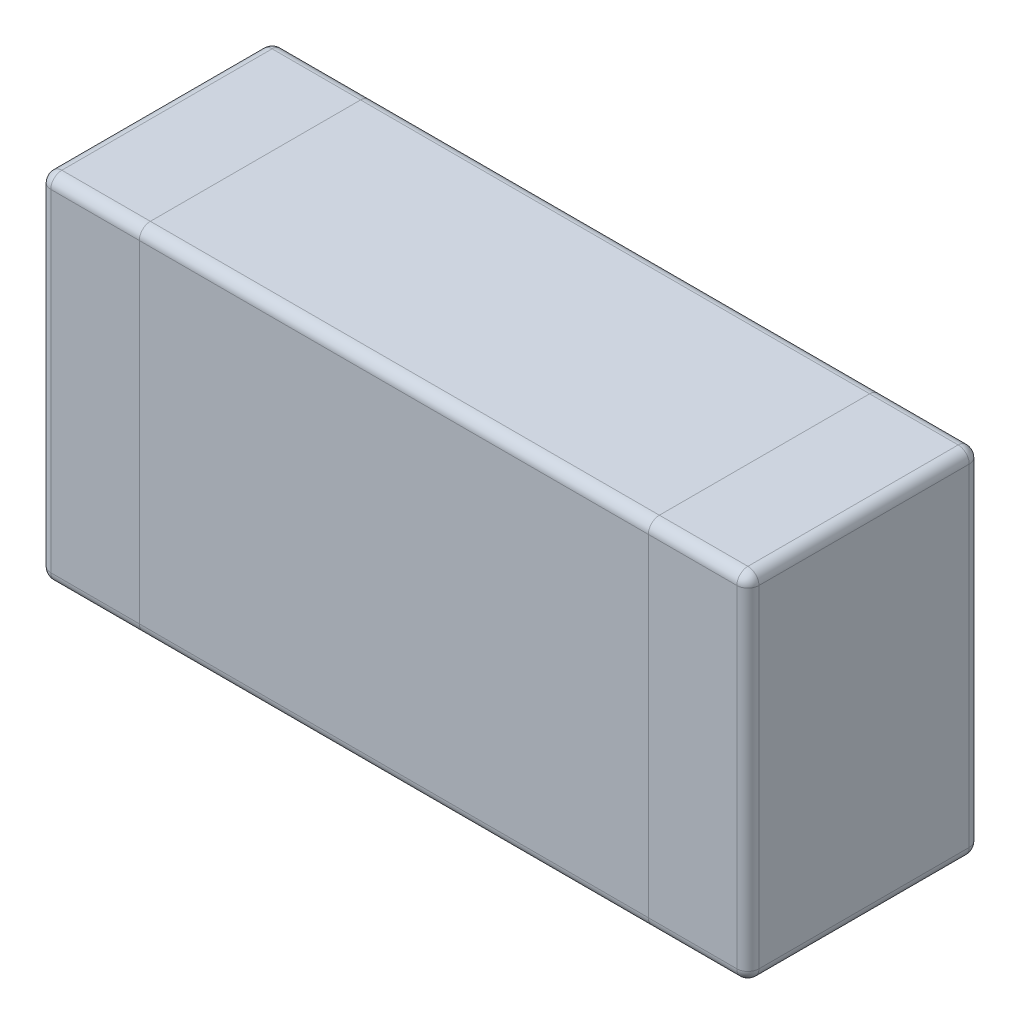
ISO-10303-21;
HEADER;
FILE_DESCRIPTION(('STEP AP214'),'2;1');
FILE_NAME('part.step','',(''),(''),'','','');
FILE_SCHEMA(('AUTOMOTIVE_DESIGN { 1 0 10303 214 1 1 1 1 }'));
ENDSEC;
DATA;
#1=APPLICATION_CONTEXT('core data for automotive mechanical design processes');
#2=APPLICATION_PROTOCOL_DEFINITION('international standard','automotive_design',2000,#1);
#3=PRODUCT_CONTEXT('',#1,'mechanical');
#4=PRODUCT('Part','Part','',(#3));
#5=PRODUCT_RELATED_PRODUCT_CATEGORY('part','',(#4));
#6=PRODUCT_DEFINITION_FORMATION('','',#4);
#7=PRODUCT_DEFINITION_CONTEXT('part definition',#1,'design');
#8=PRODUCT_DEFINITION('design','',#6,#7);
#9=PRODUCT_DEFINITION_SHAPE('','',#8);
#10=(LENGTH_UNIT() NAMED_UNIT(*) SI_UNIT(.MILLI.,.METRE.));
#11=(NAMED_UNIT(*) PLANE_ANGLE_UNIT() SI_UNIT($,.RADIAN.));
#12=(NAMED_UNIT(*) SI_UNIT($,.STERADIAN.) SOLID_ANGLE_UNIT());
#13=UNCERTAINTY_MEASURE_WITH_UNIT(LENGTH_MEASURE(1.E-05),#10,'distance_accuracy_value','');
#14=(GEOMETRIC_REPRESENTATION_CONTEXT(3) GLOBAL_UNCERTAINTY_ASSIGNED_CONTEXT((#13)) GLOBAL_UNIT_ASSIGNED_CONTEXT((#10,
#11,#12)) REPRESENTATION_CONTEXT('',''));
#15=CARTESIAN_POINT('',(0.,0.,0.));
#16=DIRECTION('',(0.,0.,1.));
#17=DIRECTION('',(1.,0.,0.));
#18=AXIS2_PLACEMENT_3D('',#15,#16,#17);
#19=CARTESIAN_POINT('',(1.55,0.749999999999718,1.0500000000002));
#20=DIRECTION('',(0.,2.68882138776405E-13,-1.));
#21=DIRECTION('',(0.,1.,2.68882138776405E-13));
#22=AXIS2_PLACEMENT_3D('',#19,#20,#21);
#23=CYLINDRICAL_SURFACE('',#22,0.05);
#24=CARTESIAN_POINT('',(1.55,0.749999999999731,1.0000000000002));
#25=DIRECTION('',(0.,2.68882138776405E-13,-1.));
#26=DIRECTION('',(0.,-1.,-2.68882138776405E-13));
#27=AXIS2_PLACEMENT_3D('',#24,#25,#26);
#28=CIRCLE('',#27,0.05);
#29=CARTESIAN_POINT('',(1.55,0.799999999999731,1.00000000000021));
#30=VERTEX_POINT('',#29);
#31=CARTESIAN_POINT('',(1.6,0.749999999999731,1.0000000000002));
#32=VERTEX_POINT('',#31);
#33=EDGE_CURVE('E27',#30,#32,#28,.T.);
#34=ORIENTED_EDGE('',*,*,#33,.T.);
#35=DIRECTION('',(0.,-2.68736422004423E-13,1.));
#36=VECTOR('',#35,1.);
#37=CARTESIAN_POINT('',(1.6,0.749999999999718,1.0500000000002));
#38=LINE('',#37,#36);
#39=CARTESIAN_POINT('',(1.6,0.749999999999987,0.0500000000002015));
#40=VERTEX_POINT('',#39);
#41=EDGE_CURVE('E208',#40,#32,#38,.T.);
#42=ORIENTED_EDGE('',*,*,#41,.F.);
#43=CARTESIAN_POINT('',(1.55,0.749999999999987,0.0500000000002015));
#44=DIRECTION('',(0.,-2.68746613504845E-13,1.));
#45=DIRECTION('',(0.,1.,2.68746613504845E-13));
#46=AXIS2_PLACEMENT_3D('',#43,#44,#45);
#47=CIRCLE('',#46,0.05);
#48=CARTESIAN_POINT('',(1.55,0.799999999999987,0.0500000000002149));
#49=VERTEX_POINT('',#48);
#50=EDGE_CURVE('E11',#40,#49,#47,.T.);
#51=ORIENTED_EDGE('',*,*,#50,.T.);
#52=DIRECTION('',(0.,2.68736422004423E-13,-1.));
#53=VECTOR('',#52,1.);
#54=CARTESIAN_POINT('',(1.55,0.799999999999718,1.05000000000021));
#55=LINE('',#54,#53);
#56=EDGE_CURVE('E210',#30,#49,#55,.T.);
#57=ORIENTED_EDGE('',*,*,#56,.F.);
#58=EDGE_LOOP('',(#34,#42,#51,#57));
#59=FACE_BOUND('',#58,.T.);
#60=ADVANCED_FACE('F17',(#59),#23,.T.);
#61=CARTESIAN_POINT('',(1.55,0.749999999999987,0.0500000000002016));
#62=DIRECTION('',(0.,-2.68736422004423E-13,1.));
#63=DIRECTION('',(1.,0.,0.));
#64=AXIS2_PLACEMENT_3D('',#61,#62,#63);
#65=SPHERICAL_SURFACE('',#64,0.05);
#66=CARTESIAN_POINT('',(1.55,0.749999999999987,0.0500000000002015));
#67=DIRECTION('',(0.,1.,2.68736422004423E-13));
#68=DIRECTION('',(-1.,0.,0.));
#69=AXIS2_PLACEMENT_3D('',#66,#67,#68);
#70=CIRCLE('',#69,0.05);
#71=CARTESIAN_POINT('',(1.55,0.75,2.01552316503317E-13));
#72=VERTEX_POINT('',#71);
#73=EDGE_CURVE('E196',#40,#72,#70,.T.);
#74=ORIENTED_EDGE('',*,*,#73,.T.);
#75=CARTESIAN_POINT('',(1.55,0.749999999999987,0.0500000000002016));
#76=DIRECTION('',(1.,0.,0.));
#77=DIRECTION('',(0.,1.,2.68746613504845E-13));
#78=AXIS2_PLACEMENT_3D('',#75,#76,#77);
#79=CIRCLE('',#78,0.05);
#80=EDGE_CURVE('E391',#72,#49,#79,.T.);
#81=ORIENTED_EDGE('',*,*,#80,.T.);
#82=ORIENTED_EDGE('',*,*,#50,.F.);
#83=EDGE_LOOP('',(#74,#81,#82));
#84=FACE_BOUND('',#83,.T.);
#85=ADVANCED_FACE('F761',(#84),#65,.T.);
#86=CARTESIAN_POINT('',(1.55,0.749999999999731,1.0000000000002));
#87=DIRECTION('',(0.,-2.68736422004423E-13,1.));
#88=DIRECTION('',(1.,0.,0.));
#89=AXIS2_PLACEMENT_3D('',#86,#87,#88);
#90=SPHERICAL_SURFACE('',#89,0.05);
#91=CARTESIAN_POINT('',(1.55,0.749999999999731,1.0000000000002));
#92=DIRECTION('',(1.,0.,0.));
#93=DIRECTION('',(0.,-2.68882138776406E-13,1.));
#94=AXIS2_PLACEMENT_3D('',#91,#92,#93);
#95=CIRCLE('',#94,0.05);
#96=CARTESIAN_POINT('',(1.55,0.749999999999718,1.0500000000002));
#97=VERTEX_POINT('',#96);
#98=EDGE_CURVE('E217',#30,#97,#95,.T.);
#99=ORIENTED_EDGE('',*,*,#98,.T.);
#100=CARTESIAN_POINT('',(1.55,0.749999999999731,1.0000000000002));
#101=DIRECTION('',(0.,1.,2.68736422004423E-13));
#102=DIRECTION('',(-1.,0.,0.));
#103=AXIS2_PLACEMENT_3D('',#100,#101,#102);
#104=CIRCLE('',#103,0.05);
#105=EDGE_CURVE('E199',#97,#32,#104,.T.);
#106=ORIENTED_EDGE('',*,*,#105,.T.);
#107=ORIENTED_EDGE('',*,*,#33,.F.);
#108=EDGE_LOOP('',(#99,#106,#107));
#109=FACE_BOUND('',#108,.T.);
#110=ADVANCED_FACE('F19',(#109),#90,.T.);
#111=CARTESIAN_POINT('',(1.55,-0.800000000000014,0.0499999999997849));
#112=DIRECTION('',(0.,-1.,-2.68736422004423E-13));
#113=DIRECTION('',(1.,0.,0.));
#114=AXIS2_PLACEMENT_3D('',#111,#112,#113);
#115=CYLINDRICAL_SURFACE('',#114,0.05);
#116=CARTESIAN_POINT('',(1.55,-0.750000000000014,0.0499999999997985));
#117=DIRECTION('',(0.,1.,2.68736422004423E-13));
#118=DIRECTION('',(1.,0.,0.));
#119=AXIS2_PLACEMENT_3D('',#116,#117,#118);
#120=CIRCLE('',#119,0.05);
#121=CARTESIAN_POINT('',(1.6,-0.750000000000014,0.0499999999997984));
#122=VERTEX_POINT('',#121);
#123=CARTESIAN_POINT('',(1.55,-0.75,-2.01552316503317E-13));
#124=VERTEX_POINT('',#123);
#125=EDGE_CURVE('E195',#122,#124,#120,.T.);
#126=ORIENTED_EDGE('',*,*,#125,.T.);
#127=DIRECTION('',(0.,-1.,-2.68736422004423E-13));
#128=VECTOR('',#127,1.);
#129=CARTESIAN_POINT('',(1.55,-0.8,-2.14989137603538E-13));
#130=LINE('',#129,#128);
#131=EDGE_CURVE('E355',#72,#124,#130,.T.);
#132=ORIENTED_EDGE('',*,*,#131,.F.);
#133=ORIENTED_EDGE('',*,*,#73,.F.);
#134=DIRECTION('',(0.,1.,2.68736422004423E-13));
#135=VECTOR('',#134,1.);
#136=CARTESIAN_POINT('',(1.6,0.799999999999987,0.0500000000002149));
#137=LINE('',#136,#135);
#138=EDGE_CURVE('E236',#122,#40,#137,.T.);
#139=ORIENTED_EDGE('',*,*,#138,.F.);
#140=EDGE_LOOP('',(#126,#132,#133,#139));
#141=FACE_BOUND('',#140,.T.);
#142=ADVANCED_FACE('F760',(#141),#115,.T.);
#143=CARTESIAN_POINT('',(-1.6,0.749999999999987,0.0500000000002015));
#144=DIRECTION('',(1.,0.,0.));
#145=DIRECTION('',(0.,1.,2.68746613504845E-13));
#146=AXIS2_PLACEMENT_3D('',#143,#144,#145);
#147=CYLINDRICAL_SURFACE('',#146,0.05);
#148=CARTESIAN_POINT('',(-1.15,0.749999999999987,0.0500000000002015));
#149=DIRECTION('',(-1.,0.,0.));
#150=DIRECTION('',(0.,1.,2.68746613504845E-13));
#151=AXIS2_PLACEMENT_3D('',#148,#149,#150);
#152=CIRCLE('',#151,0.05);
#153=CARTESIAN_POINT('',(-1.15,0.799999999999987,0.0500000000002149));
#154=VERTEX_POINT('',#153);
#155=CARTESIAN_POINT('',(-1.15,0.75,2.01552316503317E-13));
#156=VERTEX_POINT('',#155);
#157=EDGE_CURVE('E309',#154,#156,#152,.T.);
#158=ORIENTED_EDGE('',*,*,#157,.F.);
#159=DIRECTION('',(-1.,0.,0.));
#160=VECTOR('',#159,1.);
#161=CARTESIAN_POINT('',(-1.6,0.799999999999987,0.0500000000002149));
#162=LINE('',#161,#160);
#163=CARTESIAN_POINT('',(1.15,0.799999999999987,0.0500000000002149));
#164=VERTEX_POINT('',#163);
#165=EDGE_CURVE('E148',#164,#154,#162,.T.);
#166=ORIENTED_EDGE('',*,*,#165,.F.);
#167=CARTESIAN_POINT('',(1.15,0.749999999999987,0.0500000000002015));
#168=DIRECTION('',(1.,0.,0.));
#169=DIRECTION('',(0.,-1.,-2.68746613504845E-13));
#170=AXIS2_PLACEMENT_3D('',#167,#168,#169);
#171=CIRCLE('',#170,0.05);
#172=CARTESIAN_POINT('',(1.15,0.75,2.01552316503317E-13));
#173=VERTEX_POINT('',#172);
#174=EDGE_CURVE('E386',#173,#164,#171,.T.);
#175=ORIENTED_EDGE('',*,*,#174,.F.);
#176=DIRECTION('',(1.,0.,0.));
#177=VECTOR('',#176,1.);
#178=CARTESIAN_POINT('',(1.6,0.75,2.01552316503317E-13));
#179=LINE('',#178,#177);
#180=EDGE_CURVE('E176',#156,#173,#179,.T.);
#181=ORIENTED_EDGE('',*,*,#180,.F.);
#182=EDGE_LOOP('',(#158,#166,#175,#181));
#183=FACE_BOUND('',#182,.T.);
#184=ADVANCED_FACE('F771',(#183),#147,.T.);
#185=CARTESIAN_POINT('',(1.6,0.749999999999731,1.0000000000002));
#186=DIRECTION('',(-1.,0.,0.));
#187=DIRECTION('',(0.,-1.,-2.68882138776405E-13));
#188=AXIS2_PLACEMENT_3D('',#185,#186,#187);
#189=CYLINDRICAL_SURFACE('',#188,0.05);
#190=CARTESIAN_POINT('',(-1.15,0.749999999999731,1.0000000000002));
#191=DIRECTION('',(-1.,0.,0.));
#192=DIRECTION('',(0.,1.,2.68882138776405E-13));
#193=AXIS2_PLACEMENT_3D('',#190,#191,#192);
#194=CIRCLE('',#193,0.05);
#195=CARTESIAN_POINT('',(-1.15,0.749999999999718,1.0500000000002));
#196=VERTEX_POINT('',#195);
#197=CARTESIAN_POINT('',(-1.15,0.799999999999731,1.00000000000021));
#198=VERTEX_POINT('',#197);
#199=EDGE_CURVE('E358',#196,#198,#194,.T.);
#200=ORIENTED_EDGE('',*,*,#199,.F.);
#201=DIRECTION('',(-1.,0.,0.));
#202=VECTOR('',#201,1.);
#203=CARTESIAN_POINT('',(1.6,0.749999999999718,1.0500000000002));
#204=LINE('',#203,#202);
#205=CARTESIAN_POINT('',(1.15,0.749999999999718,1.0500000000002));
#206=VERTEX_POINT('',#205);
#207=EDGE_CURVE('E171',#206,#196,#204,.T.);
#208=ORIENTED_EDGE('',*,*,#207,.F.);
#209=CARTESIAN_POINT('',(1.15,0.749999999999731,1.0000000000002));
#210=DIRECTION('',(1.,0.,0.));
#211=DIRECTION('',(0.,-1.,-2.68882138776405E-13));
#212=AXIS2_PLACEMENT_3D('',#209,#210,#211);
#213=CIRCLE('',#212,0.05);
#214=CARTESIAN_POINT('',(1.15,0.799999999999731,1.00000000000021));
#215=VERTEX_POINT('',#214);
#216=EDGE_CURVE('E370',#215,#206,#213,.T.);
#217=ORIENTED_EDGE('',*,*,#216,.F.);
#218=DIRECTION('',(1.,0.,0.));
#219=VECTOR('',#218,1.);
#220=CARTESIAN_POINT('',(-1.6,0.799999999999731,1.00000000000021));
#221=LINE('',#220,#219);
#222=EDGE_CURVE('E142',#198,#215,#221,.T.);
#223=ORIENTED_EDGE('',*,*,#222,.F.);
#224=EDGE_LOOP('',(#200,#208,#217,#223));
#225=FACE_BOUND('',#224,.T.);
#226=ADVANCED_FACE('F555',(#225),#189,.T.);
#227=CARTESIAN_POINT('',(1.55,0.799999999999731,1.00000000000021));
#228=DIRECTION('',(0.,1.,2.68736422004423E-13));
#229=DIRECTION('',(-1.,0.,0.));
#230=AXIS2_PLACEMENT_3D('',#227,#228,#229);
#231=CYLINDRICAL_SURFACE('',#230,0.05);
#232=CARTESIAN_POINT('',(1.55,-0.750000000000269,0.999999999999799));
#233=DIRECTION('',(0.,1.,2.71050543121376E-13));
#234=DIRECTION('',(0.,2.71050543121376E-13,-1.));
#235=AXIS2_PLACEMENT_3D('',#232,#233,#234);
#236=CIRCLE('',#235,0.05);
#237=CARTESIAN_POINT('',(1.55,-0.750000000000283,1.0499999999998));
#238=VERTEX_POINT('',#237);
#239=CARTESIAN_POINT('',(1.6,-0.750000000000269,0.999999999999799));
#240=VERTEX_POINT('',#239);
#241=EDGE_CURVE('E159',#238,#240,#236,.T.);
#242=ORIENTED_EDGE('',*,*,#241,.T.);
#243=DIRECTION('',(0.,-1.,-2.68736422004423E-13));
#244=VECTOR('',#243,1.);
#245=CARTESIAN_POINT('',(1.6,-0.800000000000269,0.999999999999786));
#246=LINE('',#245,#244);
#247=EDGE_CURVE('E224',#32,#240,#246,.T.);
#248=ORIENTED_EDGE('',*,*,#247,.F.);
#249=ORIENTED_EDGE('',*,*,#105,.F.);
#250=DIRECTION('',(0.,1.,2.68736422004423E-13));
#251=VECTOR('',#250,1.);
#252=CARTESIAN_POINT('',(1.55,0.799999999999718,1.05000000000021));
#253=LINE('',#252,#251);
#254=EDGE_CURVE('E267',#238,#97,#253,.T.);
#255=ORIENTED_EDGE('',*,*,#254,.F.);
#256=EDGE_LOOP('',(#242,#248,#249,#255));
#257=FACE_BOUND('',#256,.T.);
#258=ADVANCED_FACE('F225',(#257),#231,.T.);
#259=CARTESIAN_POINT('',(1.55,-0.750000000000014,0.0499999999997985));
#260=DIRECTION('',(0.,-2.68736422004423E-13,1.));
#261=DIRECTION('',(1.,0.,0.));
#262=AXIS2_PLACEMENT_3D('',#259,#260,#261);
#263=SPHERICAL_SURFACE('',#262,0.05);
#264=CARTESIAN_POINT('',(1.55,-0.750000000000014,0.0499999999997984));
#265=DIRECTION('',(0.,2.68746613504845E-13,-1.));
#266=DIRECTION('',(0.,1.,2.68746613504845E-13));
#267=AXIS2_PLACEMENT_3D('',#264,#265,#266);
#268=CIRCLE('',#267,0.05);
#269=CARTESIAN_POINT('',(1.55,-0.800000000000014,0.0499999999997849));
#270=VERTEX_POINT('',#269);
#271=EDGE_CURVE('E155',#122,#270,#268,.T.);
#272=ORIENTED_EDGE('',*,*,#271,.T.);
#273=CARTESIAN_POINT('',(1.55,-0.750000000000014,0.0499999999997984));
#274=DIRECTION('',(1.,0.,0.));
#275=DIRECTION('',(0.,1.,2.68746613504845E-13));
#276=AXIS2_PLACEMENT_3D('',#273,#274,#275);
#277=CIRCLE('',#276,0.05);
#278=EDGE_CURVE('E337',#270,#124,#277,.T.);
#279=ORIENTED_EDGE('',*,*,#278,.T.);
#280=ORIENTED_EDGE('',*,*,#125,.F.);
#281=EDGE_LOOP('',(#272,#279,#280));
#282=FACE_BOUND('',#281,.T.);
#283=ADVANCED_FACE('F791',(#282),#263,.T.);
#284=CARTESIAN_POINT('',(-1.55,0.749999999999987,0.0500000000002016));
#285=DIRECTION('',(0.,-2.68736422004423E-13,1.));
#286=DIRECTION('',(1.,0.,0.));
#287=AXIS2_PLACEMENT_3D('',#284,#285,#286);
#288=SPHERICAL_SURFACE('',#287,0.05);
#289=CARTESIAN_POINT('',(-1.55,0.749999999999987,0.0500000000002016));
#290=DIRECTION('',(0.,1.,2.68736422004423E-13));
#291=DIRECTION('',(-1.,0.,0.));
#292=AXIS2_PLACEMENT_3D('',#289,#290,#291);
#293=CIRCLE('',#292,0.05);
#294=CARTESIAN_POINT('',(-1.55,0.75,2.01552316503317E-13));
#295=VERTEX_POINT('',#294);
#296=CARTESIAN_POINT('',(-1.6,0.749999999999987,0.0500000000002015));
#297=VERTEX_POINT('',#296);
#298=EDGE_CURVE('E41',#295,#297,#293,.T.);
#299=ORIENTED_EDGE('',*,*,#298,.T.);
#300=CARTESIAN_POINT('',(-1.55,0.749999999999987,0.0500000000002015));
#301=DIRECTION('',(0.,2.68746613504845E-13,-1.));
#302=DIRECTION('',(0.,1.,2.68746613504845E-13));
#303=AXIS2_PLACEMENT_3D('',#300,#301,#302);
#304=CIRCLE('',#303,0.05);
#305=CARTESIAN_POINT('',(-1.55,0.799999999999987,0.0500000000002149));
#306=VERTEX_POINT('',#305);
#307=EDGE_CURVE('E187',#297,#306,#304,.T.);
#308=ORIENTED_EDGE('',*,*,#307,.T.);
#309=CARTESIAN_POINT('',(-1.55,0.749999999999987,0.0500000000002015));
#310=DIRECTION('',(1.,0.,0.));
#311=DIRECTION('',(0.,-1.,-2.68746613504845E-13));
#312=AXIS2_PLACEMENT_3D('',#309,#310,#311);
#313=CIRCLE('',#312,0.05);
#314=EDGE_CURVE('E313',#295,#306,#313,.T.);
#315=ORIENTED_EDGE('',*,*,#314,.F.);
#316=EDGE_LOOP('',(#299,#308,#315));
#317=FACE_BOUND('',#316,.T.);
#318=ADVANCED_FACE('F801',(#317),#288,.T.);
#319=CARTESIAN_POINT('',(-1.55,0.749999999999731,1.0000000000002));
#320=DIRECTION('',(0.,-2.68736422004423E-13,1.));
#321=DIRECTION('',(1.,0.,0.));
#322=AXIS2_PLACEMENT_3D('',#319,#320,#321);
#323=SPHERICAL_SURFACE('',#322,0.05);
#324=CARTESIAN_POINT('',(-1.55,0.749999999999731,1.0000000000002));
#325=DIRECTION('',(0.,-2.68882138776405E-13,1.));
#326=DIRECTION('',(0.,-1.,-2.68882138776405E-13));
#327=AXIS2_PLACEMENT_3D('',#324,#325,#326);
#328=CIRCLE('',#327,0.05);
#329=CARTESIAN_POINT('',(-1.55,0.799999999999731,1.00000000000021));
#330=VERTEX_POINT('',#329);
#331=CARTESIAN_POINT('',(-1.6,0.749999999999732,1.0000000000002));
#332=VERTEX_POINT('',#331);
#333=EDGE_CURVE('E190',#330,#332,#328,.T.);
#334=ORIENTED_EDGE('',*,*,#333,.T.);
#335=CARTESIAN_POINT('',(-1.55,0.749999999999732,1.0000000000002));
#336=DIRECTION('',(0.,1.,2.71050543121376E-13));
#337=DIRECTION('',(0.,-2.71050543121376E-13,1.));
#338=AXIS2_PLACEMENT_3D('',#335,#336,#337);
#339=CIRCLE('',#338,0.05);
#340=CARTESIAN_POINT('',(-1.55,0.749999999999718,1.0500000000002));
#341=VERTEX_POINT('',#340);
#342=EDGE_CURVE('E131',#332,#341,#339,.T.);
#343=ORIENTED_EDGE('',*,*,#342,.T.);
#344=CARTESIAN_POINT('',(-1.55,0.749999999999731,1.0000000000002));
#345=DIRECTION('',(1.,0.,0.));
#346=DIRECTION('',(0.,-1.,-2.68882138776405E-13));
#347=AXIS2_PLACEMENT_3D('',#344,#345,#346);
#348=CIRCLE('',#347,0.05);
#349=EDGE_CURVE('E366',#330,#341,#348,.T.);
#350=ORIENTED_EDGE('',*,*,#349,.F.);
#351=EDGE_LOOP('',(#334,#343,#350));
#352=FACE_BOUND('',#351,.T.);
#353=ADVANCED_FACE('F547',(#352),#323,.T.);
#354=CARTESIAN_POINT('',(1.55,-0.750000000000269,0.999999999999799));
#355=DIRECTION('',(0.,-2.68736422004423E-13,1.));
#356=DIRECTION('',(1.,0.,0.));
#357=AXIS2_PLACEMENT_3D('',#354,#355,#356);
#358=SPHERICAL_SURFACE('',#357,0.05);
#359=CARTESIAN_POINT('',(1.55,-0.750000000000269,0.999999999999799));
#360=DIRECTION('',(1.,0.,0.));
#361=DIRECTION('',(0.,1.,2.68882138776405E-13));
#362=AXIS2_PLACEMENT_3D('',#359,#360,#361);
#363=CIRCLE('',#362,0.05);
#364=CARTESIAN_POINT('',(1.55,-0.800000000000269,0.999999999999786));
#365=VERTEX_POINT('',#364);
#366=EDGE_CURVE('E281',#238,#365,#363,.T.);
#367=ORIENTED_EDGE('',*,*,#366,.T.);
#368=CARTESIAN_POINT('',(1.55,-0.750000000000269,0.999999999999799));
#369=DIRECTION('',(0.,-2.68882138776405E-13,1.));
#370=DIRECTION('',(0.,-1.,-2.68882138776405E-13));
#371=AXIS2_PLACEMENT_3D('',#368,#369,#370);
#372=CIRCLE('',#371,0.05);
#373=EDGE_CURVE('E160',#365,#240,#372,.T.);
#374=ORIENTED_EDGE('',*,*,#373,.T.);
#375=ORIENTED_EDGE('',*,*,#241,.F.);
#376=EDGE_LOOP('',(#367,#374,#375));
#377=FACE_BOUND('',#376,.T.);
#378=ADVANCED_FACE('F818',(#377),#358,.T.);
#379=CARTESIAN_POINT('',(1.55,-0.750000000000283,1.0499999999998));
#380=DIRECTION('',(0.,2.68882138776405E-13,-1.));
#381=DIRECTION('',(0.,1.,2.68882138776405E-13));
#382=AXIS2_PLACEMENT_3D('',#379,#380,#381);
#383=CYLINDRICAL_SURFACE('',#382,0.05);
#384=ORIENTED_EDGE('',*,*,#373,.F.);
#385=DIRECTION('',(0.,-2.68736422004423E-13,1.));
#386=VECTOR('',#385,1.);
#387=CARTESIAN_POINT('',(1.55,-0.800000000000282,1.04999999999979));
#388=LINE('',#387,#386);
#389=EDGE_CURVE('E261',#270,#365,#388,.T.);
#390=ORIENTED_EDGE('',*,*,#389,.F.);
#391=ORIENTED_EDGE('',*,*,#271,.F.);
#392=DIRECTION('',(0.,2.68736422004423E-13,-1.));
#393=VECTOR('',#392,1.);
#394=CARTESIAN_POINT('',(1.6,-0.750000000000283,1.0499999999998));
#395=LINE('',#394,#393);
#396=EDGE_CURVE('E231',#240,#122,#395,.T.);
#397=ORIENTED_EDGE('',*,*,#396,.F.);
#398=EDGE_LOOP('',(#384,#390,#391,#397));
#399=FACE_BOUND('',#398,.T.);
#400=ADVANCED_FACE('F823',(#399),#383,.T.);
#401=CARTESIAN_POINT('',(-1.6,-0.750000000000014,0.0499999999997984));
#402=DIRECTION('',(-1.,0.,0.));
#403=DIRECTION('',(0.,-1.,-2.68746613504845E-13));
#404=AXIS2_PLACEMENT_3D('',#401,#402,#403);
#405=CYLINDRICAL_SURFACE('',#404,0.05);
#406=CARTESIAN_POINT('',(-1.15,-0.750000000000014,0.0499999999997984));
#407=DIRECTION('',(-1.,0.,0.));
#408=DIRECTION('',(0.,1.,2.68746613504845E-13));
#409=AXIS2_PLACEMENT_3D('',#406,#407,#408);
#410=CIRCLE('',#409,0.05);
#411=CARTESIAN_POINT('',(-1.15,-0.75,-2.01552316503317E-13));
#412=VERTEX_POINT('',#411);
#413=CARTESIAN_POINT('',(-1.15,-0.800000000000014,0.0499999999997849));
#414=VERTEX_POINT('',#413);
#415=EDGE_CURVE('E327',#412,#414,#410,.T.);
#416=ORIENTED_EDGE('',*,*,#415,.F.);
#417=DIRECTION('',(-1.,0.,0.));
#418=VECTOR('',#417,1.);
#419=CARTESIAN_POINT('',(-1.6,-0.75,-2.01552316503317E-13));
#420=LINE('',#419,#418);
#421=CARTESIAN_POINT('',(1.15,-0.75,-2.01552316503317E-13));
#422=VERTEX_POINT('',#421);
#423=EDGE_CURVE('E124',#422,#412,#420,.T.);
#424=ORIENTED_EDGE('',*,*,#423,.F.);
#425=CARTESIAN_POINT('',(1.15,-0.750000000000014,0.0499999999997984));
#426=DIRECTION('',(1.,0.,0.));
#427=DIRECTION('',(0.,-1.,-2.68746613504845E-13));
#428=AXIS2_PLACEMENT_3D('',#425,#426,#427);
#429=CIRCLE('',#428,0.05);
#430=CARTESIAN_POINT('',(1.15,-0.800000000000014,0.0499999999997849));
#431=VERTEX_POINT('',#430);
#432=EDGE_CURVE('E287',#431,#422,#429,.T.);
#433=ORIENTED_EDGE('',*,*,#432,.F.);
#434=DIRECTION('',(1.,0.,0.));
#435=VECTOR('',#434,1.);
#436=CARTESIAN_POINT('',(1.6,-0.800000000000014,0.0499999999997849));
#437=LINE('',#436,#435);
#438=EDGE_CURVE('E167',#414,#431,#437,.T.);
#439=ORIENTED_EDGE('',*,*,#438,.F.);
#440=EDGE_LOOP('',(#416,#424,#433,#439));
#441=FACE_BOUND('',#440,.T.);
#442=ADVANCED_FACE('F839',(#441),#405,.T.);
#443=CARTESIAN_POINT('',(-1.55,-0.800000000000014,0.0499999999997849));
#444=DIRECTION('',(0.,1.,2.68736422004423E-13));
#445=DIRECTION('',(-1.,0.,0.));
#446=AXIS2_PLACEMENT_3D('',#443,#444,#445);
#447=CYLINDRICAL_SURFACE('',#446,0.05);
#448=CARTESIAN_POINT('',(-1.55,-0.750000000000014,0.0499999999997984));
#449=DIRECTION('',(0.,1.,2.68736422004423E-13));
#450=DIRECTION('',(1.,0.,0.));
#451=AXIS2_PLACEMENT_3D('',#448,#449,#450);
#452=CIRCLE('',#451,0.05);
#453=CARTESIAN_POINT('',(-1.55,-0.75,-2.01552316503317E-13));
#454=VERTEX_POINT('',#453);
#455=CARTESIAN_POINT('',(-1.6,-0.750000000000014,0.0499999999997984));
#456=VERTEX_POINT('',#455);
#457=EDGE_CURVE('E89',#454,#456,#452,.T.);
#458=ORIENTED_EDGE('',*,*,#457,.T.);
#459=DIRECTION('',(0.,-1.,-2.68736422004423E-13));
#460=VECTOR('',#459,1.);
#461=CARTESIAN_POINT('',(-1.6,-0.800000000000014,0.0499999999997849));
#462=LINE('',#461,#460);
#463=EDGE_CURVE('E140',#297,#456,#462,.T.);
#464=ORIENTED_EDGE('',*,*,#463,.F.);
#465=ORIENTED_EDGE('',*,*,#298,.F.);
#466=DIRECTION('',(0.,1.,2.68736422004423E-13));
#467=VECTOR('',#466,1.);
#468=CARTESIAN_POINT('',(-1.55,0.8,2.14989137603538E-13));
#469=LINE('',#468,#467);
#470=EDGE_CURVE('E302',#454,#295,#469,.T.);
#471=ORIENTED_EDGE('',*,*,#470,.F.);
#472=EDGE_LOOP('',(#458,#464,#465,#471));
#473=FACE_BOUND('',#472,.T.);
#474=ADVANCED_FACE('F844',(#473),#447,.T.);
#475=CARTESIAN_POINT('',(-1.55,0.749999999999718,1.0500000000002));
#476=DIRECTION('',(0.,2.68882138776405E-13,-1.));
#477=DIRECTION('',(0.,1.,2.68882138776405E-13));
#478=AXIS2_PLACEMENT_3D('',#475,#476,#477);
#479=CYLINDRICAL_SURFACE('',#478,0.05);
#480=ORIENTED_EDGE('',*,*,#307,.F.);
#481=DIRECTION('',(0.,2.68736422004423E-13,-1.));
#482=VECTOR('',#481,1.);
#483=CARTESIAN_POINT('',(-1.6,0.749999999999718,1.0500000000002));
#484=LINE('',#483,#482);
#485=EDGE_CURVE('E136',#332,#297,#484,.T.);
#486=ORIENTED_EDGE('',*,*,#485,.F.);
#487=ORIENTED_EDGE('',*,*,#333,.F.);
#488=DIRECTION('',(0.,-2.68736422004423E-13,1.));
#489=VECTOR('',#488,1.);
#490=CARTESIAN_POINT('',(-1.55,0.799999999999718,1.05000000000021));
#491=LINE('',#490,#489);
#492=EDGE_CURVE('E399',#306,#330,#491,.T.);
#493=ORIENTED_EDGE('',*,*,#492,.F.);
#494=EDGE_LOOP('',(#480,#486,#487,#493));
#495=FACE_BOUND('',#494,.T.);
#496=ADVANCED_FACE('F540',(#495),#479,.T.);
#497=CARTESIAN_POINT('',(-1.55,0.799999999999731,1.00000000000021));
#498=DIRECTION('',(0.,-1.,-2.68736422004423E-13));
#499=DIRECTION('',(1.,0.,0.));
#500=AXIS2_PLACEMENT_3D('',#497,#498,#499);
#501=CYLINDRICAL_SURFACE('',#500,0.05);
#502=CARTESIAN_POINT('',(-1.55,-0.750000000000269,0.999999999999799));
#503=DIRECTION('',(0.,1.,2.68736422004423E-13));
#504=DIRECTION('',(1.,0.,0.));
#505=AXIS2_PLACEMENT_3D('',#502,#503,#504);
#506=CIRCLE('',#505,0.05);
#507=CARTESIAN_POINT('',(-1.6,-0.750000000000269,0.999999999999799));
#508=VERTEX_POINT('',#507);
#509=CARTESIAN_POINT('',(-1.55,-0.750000000000283,1.0499999999998));
#510=VERTEX_POINT('',#509);
#511=EDGE_CURVE('E99',#508,#510,#506,.T.);
#512=ORIENTED_EDGE('',*,*,#511,.T.);
#513=DIRECTION('',(0.,-1.,-2.68736422004423E-13));
#514=VECTOR('',#513,1.);
#515=CARTESIAN_POINT('',(-1.55,0.799999999999718,1.05000000000021));
#516=LINE('',#515,#514);
#517=EDGE_CURVE('E441',#341,#510,#516,.T.);
#518=ORIENTED_EDGE('',*,*,#517,.F.);
#519=ORIENTED_EDGE('',*,*,#342,.F.);
#520=DIRECTION('',(0.,1.,2.68736422004423E-13));
#521=VECTOR('',#520,1.);
#522=CARTESIAN_POINT('',(-1.6,-0.800000000000269,0.999999999999786));
#523=LINE('',#522,#521);
#524=EDGE_CURVE('E128',#508,#332,#523,.T.);
#525=ORIENTED_EDGE('',*,*,#524,.F.);
#526=EDGE_LOOP('',(#512,#518,#519,#525));
#527=FACE_BOUND('',#526,.T.);
#528=ADVANCED_FACE('F129',(#527),#501,.T.);
#529=CARTESIAN_POINT('',(1.6,-0.750000000000269,0.999999999999799));
#530=DIRECTION('',(1.,0.,0.));
#531=DIRECTION('',(0.,1.,2.68882138776405E-13));
#532=AXIS2_PLACEMENT_3D('',#529,#530,#531);
#533=CYLINDRICAL_SURFACE('',#532,0.05);
#534=CARTESIAN_POINT('',(-1.15,-0.750000000000269,0.999999999999799));
#535=DIRECTION('',(-1.,0.,0.));
#536=DIRECTION('',(0.,1.,2.68882138776405E-13));
#537=AXIS2_PLACEMENT_3D('',#534,#535,#536);
#538=CIRCLE('',#537,0.05);
#539=CARTESIAN_POINT('',(-1.15,-0.800000000000269,0.999999999999786));
#540=VERTEX_POINT('',#539);
#541=CARTESIAN_POINT('',(-1.15,-0.750000000000283,1.0499999999998));
#542=VERTEX_POINT('',#541);
#543=EDGE_CURVE('E280',#540,#542,#538,.T.);
#544=ORIENTED_EDGE('',*,*,#543,.F.);
#545=DIRECTION('',(-1.,0.,0.));
#546=VECTOR('',#545,1.);
#547=CARTESIAN_POINT('',(-1.6,-0.800000000000269,0.999999999999786));
#548=LINE('',#547,#546);
#549=CARTESIAN_POINT('',(1.15,-0.800000000000269,0.999999999999786));
#550=VERTEX_POINT('',#549);
#551=EDGE_CURVE('E163',#550,#540,#548,.T.);
#552=ORIENTED_EDGE('',*,*,#551,.F.);
#553=CARTESIAN_POINT('',(1.15,-0.750000000000269,0.999999999999799));
#554=DIRECTION('',(1.,0.,0.));
#555=DIRECTION('',(0.,-1.,-2.68882138776405E-13));
#556=AXIS2_PLACEMENT_3D('',#553,#554,#555);
#557=CIRCLE('',#556,0.05);
#558=CARTESIAN_POINT('',(1.15,-0.750000000000283,1.0499999999998));
#559=VERTEX_POINT('',#558);
#560=EDGE_CURVE('E293',#559,#550,#557,.T.);
#561=ORIENTED_EDGE('',*,*,#560,.F.);
#562=DIRECTION('',(1.,0.,0.));
#563=VECTOR('',#562,1.);
#564=CARTESIAN_POINT('',(1.6,-0.750000000000283,1.0499999999998));
#565=LINE('',#564,#563);
#566=EDGE_CURVE('E172',#542,#559,#565,.T.);
#567=ORIENTED_EDGE('',*,*,#566,.F.);
#568=EDGE_LOOP('',(#544,#552,#561,#567));
#569=FACE_BOUND('',#568,.T.);
#570=ADVANCED_FACE('F486',(#569),#533,.T.);
#571=CARTESIAN_POINT('',(-1.55,-0.750000000000014,0.0499999999997985));
#572=DIRECTION('',(0.,-2.68736422004423E-13,1.));
#573=DIRECTION('',(1.,0.,0.));
#574=AXIS2_PLACEMENT_3D('',#571,#572,#573);
#575=SPHERICAL_SURFACE('',#574,0.05);
#576=CARTESIAN_POINT('',(-1.55,-0.750000000000014,0.0499999999997985));
#577=DIRECTION('',(1.,0.,0.));
#578=DIRECTION('',(0.,-1.,-2.70508442035133E-13));
#579=AXIS2_PLACEMENT_3D('',#576,#577,#578);
#580=CIRCLE('',#579,0.05);
#581=CARTESIAN_POINT('',(-1.55,-0.800000000000014,0.0499999999997849));
#582=VERTEX_POINT('',#581);
#583=EDGE_CURVE('E292',#582,#454,#580,.T.);
#584=ORIENTED_EDGE('',*,*,#583,.F.);
#585=CARTESIAN_POINT('',(-1.55,-0.750000000000014,0.0499999999997984));
#586=DIRECTION('',(0.,2.68746613504845E-13,-1.));
#587=DIRECTION('',(0.,1.,2.68746613504845E-13));
#588=AXIS2_PLACEMENT_3D('',#585,#586,#587);
#589=CIRCLE('',#588,0.05);
#590=EDGE_CURVE('E113',#582,#456,#589,.T.);
#591=ORIENTED_EDGE('',*,*,#590,.T.);
#592=ORIENTED_EDGE('',*,*,#457,.F.);
#593=EDGE_LOOP('',(#584,#591,#592));
#594=FACE_BOUND('',#593,.T.);
#595=ADVANCED_FACE('F874',(#594),#575,.T.);
#596=CARTESIAN_POINT('',(-1.55,-0.750000000000269,0.999999999999799));
#597=DIRECTION('',(0.,-2.68736422004423E-13,1.));
#598=DIRECTION('',(1.,0.,0.));
#599=AXIS2_PLACEMENT_3D('',#596,#597,#598);
#600=SPHERICAL_SURFACE('',#599,0.05);
#601=ORIENTED_EDGE('',*,*,#511,.F.);
#602=CARTESIAN_POINT('',(-1.55,-0.750000000000269,0.999999999999799));
#603=DIRECTION('',(0.,-2.68882138776405E-13,1.));
#604=DIRECTION('',(0.,-1.,-2.68882138776405E-13));
#605=AXIS2_PLACEMENT_3D('',#602,#603,#604);
#606=CIRCLE('',#605,0.05);
#607=CARTESIAN_POINT('',(-1.55,-0.800000000000269,0.999999999999786));
#608=VERTEX_POINT('',#607);
#609=EDGE_CURVE('E103',#508,#608,#606,.T.);
#610=ORIENTED_EDGE('',*,*,#609,.T.);
#611=CARTESIAN_POINT('',(-1.55,-0.750000000000269,0.999999999999799));
#612=DIRECTION('',(1.,0.,0.));
#613=DIRECTION('',(0.,2.68882138776405E-13,-1.));
#614=AXIS2_PLACEMENT_3D('',#611,#612,#613);
#615=CIRCLE('',#614,0.05);
#616=EDGE_CURVE('E107',#510,#608,#615,.T.);
#617=ORIENTED_EDGE('',*,*,#616,.F.);
#618=EDGE_LOOP('',(#601,#610,#617));
#619=FACE_BOUND('',#618,.T.);
#620=ADVANCED_FACE('F101',(#619),#600,.T.);
#621=CARTESIAN_POINT('',(-1.55,-0.750000000000283,1.0499999999998));
#622=DIRECTION('',(0.,2.68882138776405E-13,-1.));
#623=DIRECTION('',(0.,1.,2.68882138776405E-13));
#624=AXIS2_PLACEMENT_3D('',#621,#622,#623);
#625=CYLINDRICAL_SURFACE('',#624,0.05);
#626=ORIENTED_EDGE('',*,*,#609,.F.);
#627=DIRECTION('',(0.,-2.68736422004423E-13,1.));
#628=VECTOR('',#627,1.);
#629=CARTESIAN_POINT('',(-1.6,-0.750000000000283,1.0499999999998));
#630=LINE('',#629,#628);
#631=EDGE_CURVE('E120',#456,#508,#630,.T.);
#632=ORIENTED_EDGE('',*,*,#631,.F.);
#633=ORIENTED_EDGE('',*,*,#590,.F.);
#634=DIRECTION('',(0.,2.68736422004423E-13,-1.));
#635=VECTOR('',#634,1.);
#636=CARTESIAN_POINT('',(-1.55,-0.800000000000282,1.04999999999979));
#637=LINE('',#636,#635);
#638=EDGE_CURVE('E122',#608,#582,#637,.T.);
#639=ORIENTED_EDGE('',*,*,#638,.F.);
#640=EDGE_LOOP('',(#626,#632,#633,#639));
#641=FACE_BOUND('',#640,.T.);
#642=ADVANCED_FACE('F117',(#641),#625,.T.);
#643=CARTESIAN_POINT('',(1.6,0.8,2.14989137603538E-13));
#644=DIRECTION('',(0.,2.68736422004423E-13,-1.));
#645=DIRECTION('',(-1.,0.,0.));
#646=AXIS2_PLACEMENT_3D('',#643,#644,#645);
#647=PLANE('',#646);
#648=DIRECTION('',(0.,-1.,-2.68736422004423E-13));
#649=VECTOR('',#648,1.);
#650=CARTESIAN_POINT('',(-1.15,0.8,2.14989137603538E-13));
#651=LINE('',#650,#649);
#652=EDGE_CURVE('E345',#156,#412,#651,.T.);
#653=ORIENTED_EDGE('',*,*,#652,.F.);
#654=ORIENTED_EDGE('',*,*,#180,.T.);
#655=DIRECTION('',(0.,1.,2.68736422004423E-13));
#656=VECTOR('',#655,1.);
#657=CARTESIAN_POINT('',(1.15,0.8,2.14989137603538E-13));
#658=LINE('',#657,#656);
#659=EDGE_CURVE('E297',#422,#173,#658,.T.);
#660=ORIENTED_EDGE('',*,*,#659,.F.);
#661=ORIENTED_EDGE('',*,*,#423,.T.);
#662=EDGE_LOOP('',(#653,#654,#660,#661));
#663=FACE_BOUND('',#662,.T.);
#664=ADVANCED_FACE('F910',(#663),#647,.T.);
#665=CARTESIAN_POINT('',(1.6,0.799999999999718,1.05000000000021));
#666=DIRECTION('',(0.,2.68736422004423E-13,-1.));
#667=DIRECTION('',(-1.,0.,0.));
#668=AXIS2_PLACEMENT_3D('',#665,#666,#667);
#669=PLANE('',#668);
#670=ORIENTED_EDGE('',*,*,#207,.T.);
#671=DIRECTION('',(0.,-1.,-2.68736422004423E-13));
#672=VECTOR('',#671,1.);
#673=CARTESIAN_POINT('',(-1.15,0.799999999999718,1.05000000000021));
#674=LINE('',#673,#672);
#675=EDGE_CURVE('E430',#196,#542,#674,.T.);
#676=ORIENTED_EDGE('',*,*,#675,.T.);
#677=ORIENTED_EDGE('',*,*,#566,.T.);
#678=DIRECTION('',(0.,1.,2.68736422004423E-13));
#679=VECTOR('',#678,1.);
#680=CARTESIAN_POINT('',(1.15,0.799999999999718,1.05000000000021));
#681=LINE('',#680,#679);
#682=EDGE_CURVE('E268',#559,#206,#681,.T.);
#683=ORIENTED_EDGE('',*,*,#682,.T.);
#684=EDGE_LOOP('',(#670,#676,#677,#683));
#685=FACE_BOUND('',#684,.T.);
#686=ADVANCED_FACE('F915',(#685),#669,.F.);
#687=CARTESIAN_POINT('',(-1.6,-0.800000000000282,1.04999999999979));
#688=DIRECTION('',(0.,1.,2.68736422004423E-13));
#689=DIRECTION('',(0.,2.68736422004423E-13,-1.));
#690=AXIS2_PLACEMENT_3D('',#687,#688,#689);
#691=PLANE('',#690);
#692=ORIENTED_EDGE('',*,*,#551,.T.);
#693=DIRECTION('',(0.,2.68736422004423E-13,-1.));
#694=VECTOR('',#693,1.);
#695=CARTESIAN_POINT('',(-1.15,-0.800000000000282,1.04999999999979));
#696=LINE('',#695,#694);
#697=EDGE_CURVE('E285',#540,#414,#696,.T.);
#698=ORIENTED_EDGE('',*,*,#697,.T.);
#699=ORIENTED_EDGE('',*,*,#438,.T.);
#700=DIRECTION('',(0.,-2.68736422004423E-13,1.));
#701=VECTOR('',#700,1.);
#702=CARTESIAN_POINT('',(1.15,-0.800000000000282,1.04999999999979));
#703=LINE('',#702,#701);
#704=EDGE_CURVE('E262',#431,#550,#703,.T.);
#705=ORIENTED_EDGE('',*,*,#704,.T.);
#706=EDGE_LOOP('',(#692,#698,#699,#705));
#707=FACE_BOUND('',#706,.T.);
#708=ADVANCED_FACE('F467',(#707),#691,.F.);
#709=CARTESIAN_POINT('',(-1.6,-0.800000000000282,1.04999999999979));
#710=DIRECTION('',(1.,0.,0.));
#711=DIRECTION('',(0.,1.,0.));
#712=AXIS2_PLACEMENT_3D('',#709,#710,#711);
#713=PLANE('',#712);
#714=ORIENTED_EDGE('',*,*,#631,.T.);
#715=ORIENTED_EDGE('',*,*,#524,.T.);
#716=ORIENTED_EDGE('',*,*,#485,.T.);
#717=ORIENTED_EDGE('',*,*,#463,.T.);
#718=EDGE_LOOP('',(#714,#715,#716,#717));
#719=FACE_BOUND('',#718,.T.);
#720=ADVANCED_FACE('F139',(#719),#713,.F.);
#721=CARTESIAN_POINT('',(-1.6,0.799999999999718,1.05000000000021));
#722=DIRECTION('',(0.,-1.,-2.68736422004423E-13));
#723=DIRECTION('',(0.,2.68736422004423E-13,-1.));
#724=AXIS2_PLACEMENT_3D('',#721,#722,#723);
#725=PLANE('',#724);
#726=ORIENTED_EDGE('',*,*,#165,.T.);
#727=DIRECTION('',(0.,-2.68736422004423E-13,1.));
#728=VECTOR('',#727,1.);
#729=CARTESIAN_POINT('',(-1.15,0.799999999999718,1.05000000000021));
#730=LINE('',#729,#728);
#731=EDGE_CURVE('E395',#154,#198,#730,.T.);
#732=ORIENTED_EDGE('',*,*,#731,.T.);
#733=ORIENTED_EDGE('',*,*,#222,.T.);
#734=DIRECTION('',(0.,2.68736422004423E-13,-1.));
#735=VECTOR('',#734,1.);
#736=CARTESIAN_POINT('',(1.15,0.799999999999718,1.05000000000021));
#737=LINE('',#736,#735);
#738=EDGE_CURVE('E242',#215,#164,#737,.T.);
#739=ORIENTED_EDGE('',*,*,#738,.T.);
#740=EDGE_LOOP('',(#726,#732,#733,#739));
#741=FACE_BOUND('',#740,.T.);
#742=ADVANCED_FACE('F408',(#741),#725,.F.);
#743=CARTESIAN_POINT('',(1.6,-0.800000000000282,1.04999999999979));
#744=DIRECTION('',(-1.,0.,0.));
#745=DIRECTION('',(0.,0.,1.));
#746=AXIS2_PLACEMENT_3D('',#743,#744,#745);
#747=PLANE('',#746);
#748=ORIENTED_EDGE('',*,*,#41,.T.);
#749=ORIENTED_EDGE('',*,*,#247,.T.);
#750=ORIENTED_EDGE('',*,*,#396,.T.);
#751=ORIENTED_EDGE('',*,*,#138,.T.);
#752=EDGE_LOOP('',(#748,#749,#750,#751));
#753=FACE_BOUND('',#752,.T.);
#754=ADVANCED_FACE('F234',(#753),#747,.F.);
#755=CARTESIAN_POINT('',(-1.6,0.799999999999718,1.05000000000021));
#756=DIRECTION('',(0.,-1.,-2.68736422004423E-13));
#757=DIRECTION('',(0.,2.68736422004423E-13,-1.));
#758=AXIS2_PLACEMENT_3D('',#755,#756,#757);
#759=PLANE('',#758);
#760=ORIENTED_EDGE('',*,*,#738,.F.);
#761=DIRECTION('',(1.,0.,0.));
#762=VECTOR('',#761,1.);
#763=CARTESIAN_POINT('',(-1.6,0.799999999999731,1.00000000000021));
#764=LINE('',#763,#762);
#765=EDGE_CURVE('E367',#215,#30,#764,.T.);
#766=ORIENTED_EDGE('',*,*,#765,.T.);
#767=ORIENTED_EDGE('',*,*,#56,.T.);
#768=DIRECTION('',(-1.,0.,0.));
#769=VECTOR('',#768,1.);
#770=CARTESIAN_POINT('',(-1.6,0.799999999999987,0.0500000000002149));
#771=LINE('',#770,#769);
#772=EDGE_CURVE('E387',#49,#164,#771,.T.);
#773=ORIENTED_EDGE('',*,*,#772,.T.);
#774=EDGE_LOOP('',(#760,#766,#767,#773));
#775=FACE_BOUND('',#774,.T.);
#776=ADVANCED_FACE('F415',(#775),#759,.F.);
#777=CARTESIAN_POINT('',(-1.6,0.799999999999718,1.05000000000021));
#778=DIRECTION('',(0.,-1.,-2.68736422004423E-13));
#779=DIRECTION('',(0.,2.68736422004423E-13,-1.));
#780=AXIS2_PLACEMENT_3D('',#777,#778,#779);
#781=PLANE('',#780);
#782=ORIENTED_EDGE('',*,*,#731,.F.);
#783=DIRECTION('',(-1.,0.,0.));
#784=VECTOR('',#783,1.);
#785=CARTESIAN_POINT('',(-1.6,0.799999999999987,0.0500000000002149));
#786=LINE('',#785,#784);
#787=EDGE_CURVE('E314',#154,#306,#786,.T.);
#788=ORIENTED_EDGE('',*,*,#787,.T.);
#789=ORIENTED_EDGE('',*,*,#492,.T.);
#790=DIRECTION('',(1.,0.,0.));
#791=VECTOR('',#790,1.);
#792=CARTESIAN_POINT('',(-1.6,0.799999999999731,1.00000000000021));
#793=LINE('',#792,#791);
#794=EDGE_CURVE('E362',#330,#198,#793,.T.);
#795=ORIENTED_EDGE('',*,*,#794,.T.);
#796=EDGE_LOOP('',(#782,#788,#789,#795));
#797=FACE_BOUND('',#796,.T.);
#798=ADVANCED_FACE('F544',(#797),#781,.F.);
#799=CARTESIAN_POINT('',(-1.6,0.749999999999987,0.0500000000002015));
#800=DIRECTION('',(1.,0.,0.));
#801=DIRECTION('',(0.,1.,2.68746613504845E-13));
#802=AXIS2_PLACEMENT_3D('',#799,#800,#801);
#803=CYLINDRICAL_SURFACE('',#802,0.05);
#804=DIRECTION('',(1.,0.,0.));
#805=VECTOR('',#804,1.);
#806=CARTESIAN_POINT('',(1.6,0.75,2.01552316503317E-13));
#807=LINE('',#806,#805);
#808=EDGE_CURVE('E301',#173,#72,#807,.T.);
#809=ORIENTED_EDGE('',*,*,#808,.F.);
#810=ORIENTED_EDGE('',*,*,#174,.T.);
#811=ORIENTED_EDGE('',*,*,#772,.F.);
#812=ORIENTED_EDGE('',*,*,#80,.F.);
#813=EDGE_LOOP('',(#809,#810,#811,#812));
#814=FACE_BOUND('',#813,.T.);
#815=ADVANCED_FACE('F420',(#814),#803,.T.);
#816=CARTESIAN_POINT('',(-1.6,0.749999999999987,0.0500000000002015));
#817=DIRECTION('',(1.,0.,0.));
#818=DIRECTION('',(0.,1.,2.68746613504845E-13));
#819=AXIS2_PLACEMENT_3D('',#816,#817,#818);
#820=CYLINDRICAL_SURFACE('',#819,0.05);
#821=ORIENTED_EDGE('',*,*,#787,.F.);
#822=ORIENTED_EDGE('',*,*,#157,.T.);
#823=DIRECTION('',(1.,0.,0.));
#824=VECTOR('',#823,1.);
#825=CARTESIAN_POINT('',(1.6,0.75,2.01552316503317E-13));
#826=LINE('',#825,#824);
#827=EDGE_CURVE('E341',#295,#156,#826,.T.);
#828=ORIENTED_EDGE('',*,*,#827,.F.);
#829=ORIENTED_EDGE('',*,*,#314,.T.);
#830=EDGE_LOOP('',(#821,#822,#828,#829));
#831=FACE_BOUND('',#830,.T.);
#832=ADVANCED_FACE('F985',(#831),#820,.T.);
#833=CARTESIAN_POINT('',(1.6,0.749999999999731,1.0000000000002));
#834=DIRECTION('',(-1.,0.,0.));
#835=DIRECTION('',(0.,-1.,-2.68882138776405E-13));
#836=AXIS2_PLACEMENT_3D('',#833,#834,#835);
#837=CYLINDRICAL_SURFACE('',#836,0.05);
#838=ORIENTED_EDGE('',*,*,#765,.F.);
#839=ORIENTED_EDGE('',*,*,#216,.T.);
#840=DIRECTION('',(-1.,0.,0.));
#841=VECTOR('',#840,1.);
#842=CARTESIAN_POINT('',(1.6,0.749999999999718,1.0500000000002));
#843=LINE('',#842,#841);
#844=EDGE_CURVE('E272',#97,#206,#843,.T.);
#845=ORIENTED_EDGE('',*,*,#844,.F.);
#846=ORIENTED_EDGE('',*,*,#98,.F.);
#847=EDGE_LOOP('',(#838,#839,#845,#846));
#848=FACE_BOUND('',#847,.T.);
#849=ADVANCED_FACE('F990',(#848),#837,.T.);
#850=CARTESIAN_POINT('',(1.6,0.749999999999731,1.0000000000002));
#851=DIRECTION('',(-1.,0.,0.));
#852=DIRECTION('',(0.,-1.,-2.68882138776405E-13));
#853=AXIS2_PLACEMENT_3D('',#850,#851,#852);
#854=CYLINDRICAL_SURFACE('',#853,0.05);
#855=DIRECTION('',(-1.,0.,0.));
#856=VECTOR('',#855,1.);
#857=CARTESIAN_POINT('',(1.6,0.749999999999718,1.0500000000002));
#858=LINE('',#857,#856);
#859=EDGE_CURVE('E437',#196,#341,#858,.T.);
#860=ORIENTED_EDGE('',*,*,#859,.F.);
#861=ORIENTED_EDGE('',*,*,#199,.T.);
#862=ORIENTED_EDGE('',*,*,#794,.F.);
#863=ORIENTED_EDGE('',*,*,#349,.T.);
#864=EDGE_LOOP('',(#860,#861,#862,#863));
#865=FACE_BOUND('',#864,.T.);
#866=ADVANCED_FACE('F551',(#865),#854,.T.);
#867=CARTESIAN_POINT('',(1.6,0.8,2.14989137603538E-13));
#868=DIRECTION('',(0.,2.68736422004423E-13,-1.));
#869=DIRECTION('',(-1.,0.,0.));
#870=AXIS2_PLACEMENT_3D('',#867,#868,#869);
#871=PLANE('',#870);
#872=DIRECTION('',(-1.,0.,0.));
#873=VECTOR('',#872,1.);
#874=CARTESIAN_POINT('',(-1.6,-0.75,-2.01552316503317E-13));
#875=LINE('',#874,#873);
#876=EDGE_CURVE('E291',#124,#422,#875,.T.);
#877=ORIENTED_EDGE('',*,*,#876,.T.);
#878=ORIENTED_EDGE('',*,*,#659,.T.);
#879=ORIENTED_EDGE('',*,*,#808,.T.);
#880=ORIENTED_EDGE('',*,*,#131,.T.);
#881=EDGE_LOOP('',(#877,#878,#879,#880));
#882=FACE_BOUND('',#881,.T.);
#883=ADVANCED_FACE('F1024',(#882),#871,.T.);
#884=CARTESIAN_POINT('',(1.6,0.8,2.14989137603538E-13));
#885=DIRECTION('',(0.,2.68736422004423E-13,-1.));
#886=DIRECTION('',(-1.,0.,0.));
#887=AXIS2_PLACEMENT_3D('',#884,#885,#886);
#888=PLANE('',#887);
#889=ORIENTED_EDGE('',*,*,#827,.T.);
#890=ORIENTED_EDGE('',*,*,#652,.T.);
#891=DIRECTION('',(-1.,0.,0.));
#892=VECTOR('',#891,1.);
#893=CARTESIAN_POINT('',(-1.6,-0.75,-2.01552316503317E-13));
#894=LINE('',#893,#892);
#895=EDGE_CURVE('E324',#412,#454,#894,.T.);
#896=ORIENTED_EDGE('',*,*,#895,.T.);
#897=ORIENTED_EDGE('',*,*,#470,.T.);
#898=EDGE_LOOP('',(#889,#890,#896,#897));
#899=FACE_BOUND('',#898,.T.);
#900=ADVANCED_FACE('F1018',(#899),#888,.T.);
#901=CARTESIAN_POINT('',(-1.6,-0.750000000000014,0.0499999999997984));
#902=DIRECTION('',(-1.,0.,0.));
#903=DIRECTION('',(0.,-1.,-2.68746613504845E-13));
#904=AXIS2_PLACEMENT_3D('',#901,#902,#903);
#905=CYLINDRICAL_SURFACE('',#904,0.05);
#906=DIRECTION('',(1.,0.,0.));
#907=VECTOR('',#906,1.);
#908=CARTESIAN_POINT('',(1.6,-0.800000000000014,0.0499999999997849));
#909=LINE('',#908,#907);
#910=EDGE_CURVE('E257',#431,#270,#909,.T.);
#911=ORIENTED_EDGE('',*,*,#910,.F.);
#912=ORIENTED_EDGE('',*,*,#432,.T.);
#913=ORIENTED_EDGE('',*,*,#876,.F.);
#914=ORIENTED_EDGE('',*,*,#278,.F.);
#915=EDGE_LOOP('',(#911,#912,#913,#914));
#916=FACE_BOUND('',#915,.T.);
#917=ADVANCED_FACE('F1023',(#916),#905,.T.);
#918=CARTESIAN_POINT('',(-1.6,-0.750000000000014,0.0499999999997984));
#919=DIRECTION('',(-1.,0.,0.));
#920=DIRECTION('',(0.,-1.,-2.68746613504845E-13));
#921=AXIS2_PLACEMENT_3D('',#918,#919,#920);
#922=CYLINDRICAL_SURFACE('',#921,0.05);
#923=ORIENTED_EDGE('',*,*,#895,.F.);
#924=ORIENTED_EDGE('',*,*,#415,.T.);
#925=DIRECTION('',(1.,0.,0.));
#926=VECTOR('',#925,1.);
#927=CARTESIAN_POINT('',(1.6,-0.800000000000014,0.0499999999997849));
#928=LINE('',#927,#926);
#929=EDGE_CURVE('E308',#582,#414,#928,.T.);
#930=ORIENTED_EDGE('',*,*,#929,.F.);
#931=ORIENTED_EDGE('',*,*,#583,.T.);
#932=EDGE_LOOP('',(#923,#924,#930,#931));
#933=FACE_BOUND('',#932,.T.);
#934=ADVANCED_FACE('F1036',(#933),#922,.T.);
#935=CARTESIAN_POINT('',(-1.6,-0.800000000000282,1.04999999999979));
#936=DIRECTION('',(0.,1.,2.68736422004423E-13));
#937=DIRECTION('',(0.,2.68736422004423E-13,-1.));
#938=AXIS2_PLACEMENT_3D('',#935,#936,#937);
#939=PLANE('',#938);
#940=ORIENTED_EDGE('',*,*,#704,.F.);
#941=ORIENTED_EDGE('',*,*,#910,.T.);
#942=ORIENTED_EDGE('',*,*,#389,.T.);
#943=DIRECTION('',(-1.,0.,0.));
#944=VECTOR('',#943,1.);
#945=CARTESIAN_POINT('',(-1.6,-0.800000000000269,0.999999999999786));
#946=LINE('',#945,#944);
#947=EDGE_CURVE('E286',#365,#550,#946,.T.);
#948=ORIENTED_EDGE('',*,*,#947,.T.);
#949=EDGE_LOOP('',(#940,#941,#942,#948));
#950=FACE_BOUND('',#949,.T.);
#951=ADVANCED_FACE('F1047',(#950),#939,.F.);
#952=CARTESIAN_POINT('',(-1.6,-0.800000000000282,1.04999999999979));
#953=DIRECTION('',(0.,1.,2.68736422004423E-13));
#954=DIRECTION('',(0.,2.68736422004423E-13,-1.));
#955=AXIS2_PLACEMENT_3D('',#952,#953,#954);
#956=PLANE('',#955);
#957=ORIENTED_EDGE('',*,*,#697,.F.);
#958=DIRECTION('',(-1.,0.,0.));
#959=VECTOR('',#958,1.);
#960=CARTESIAN_POINT('',(-1.6,-0.800000000000269,0.999999999999786));
#961=LINE('',#960,#959);
#962=EDGE_CURVE('E276',#540,#608,#961,.T.);
#963=ORIENTED_EDGE('',*,*,#962,.T.);
#964=ORIENTED_EDGE('',*,*,#638,.T.);
#965=ORIENTED_EDGE('',*,*,#929,.T.);
#966=EDGE_LOOP('',(#957,#963,#964,#965));
#967=FACE_BOUND('',#966,.T.);
#968=ADVANCED_FACE('F479',(#967),#956,.F.);
#969=CARTESIAN_POINT('',(1.6,-0.750000000000269,0.999999999999799));
#970=DIRECTION('',(1.,0.,0.));
#971=DIRECTION('',(0.,1.,2.68882138776405E-13));
#972=AXIS2_PLACEMENT_3D('',#969,#970,#971);
#973=CYLINDRICAL_SURFACE('',#972,0.05);
#974=DIRECTION('',(1.,0.,0.));
#975=VECTOR('',#974,1.);
#976=CARTESIAN_POINT('',(1.6,-0.750000000000283,1.0499999999998));
#977=LINE('',#976,#975);
#978=EDGE_CURVE('E263',#559,#238,#977,.T.);
#979=ORIENTED_EDGE('',*,*,#978,.F.);
#980=ORIENTED_EDGE('',*,*,#560,.T.);
#981=ORIENTED_EDGE('',*,*,#947,.F.);
#982=ORIENTED_EDGE('',*,*,#366,.F.);
#983=EDGE_LOOP('',(#979,#980,#981,#982));
#984=FACE_BOUND('',#983,.T.);
#985=ADVANCED_FACE('F1093',(#984),#973,.T.);
#986=CARTESIAN_POINT('',(1.6,-0.750000000000269,0.999999999999799));
#987=DIRECTION('',(1.,0.,0.));
#988=DIRECTION('',(0.,1.,2.68882138776405E-13));
#989=AXIS2_PLACEMENT_3D('',#986,#987,#988);
#990=CYLINDRICAL_SURFACE('',#989,0.05);
#991=ORIENTED_EDGE('',*,*,#962,.F.);
#992=ORIENTED_EDGE('',*,*,#543,.T.);
#993=DIRECTION('',(1.,0.,0.));
#994=VECTOR('',#993,1.);
#995=CARTESIAN_POINT('',(1.6,-0.750000000000283,1.0499999999998));
#996=LINE('',#995,#994);
#997=EDGE_CURVE('E448',#510,#542,#996,.T.);
#998=ORIENTED_EDGE('',*,*,#997,.F.);
#999=ORIENTED_EDGE('',*,*,#616,.T.);
#1000=EDGE_LOOP('',(#991,#992,#998,#999));
#1001=FACE_BOUND('',#1000,.T.);
#1002=ADVANCED_FACE('F491',(#1001),#990,.T.);
#1003=CARTESIAN_POINT('',(1.6,0.799999999999718,1.05000000000021));
#1004=DIRECTION('',(0.,2.68736422004423E-13,-1.));
#1005=DIRECTION('',(-1.,0.,0.));
#1006=AXIS2_PLACEMENT_3D('',#1003,#1004,#1005);
#1007=PLANE('',#1006);
#1008=ORIENTED_EDGE('',*,*,#682,.F.);
#1009=ORIENTED_EDGE('',*,*,#978,.T.);
#1010=ORIENTED_EDGE('',*,*,#254,.T.);
#1011=ORIENTED_EDGE('',*,*,#844,.T.);
#1012=EDGE_LOOP('',(#1008,#1009,#1010,#1011));
#1013=FACE_BOUND('',#1012,.T.);
#1014=ADVANCED_FACE('F1112',(#1013),#1007,.F.);
#1015=CARTESIAN_POINT('',(1.6,0.799999999999718,1.05000000000021));
#1016=DIRECTION('',(0.,2.68736422004423E-13,-1.));
#1017=DIRECTION('',(-1.,0.,0.));
#1018=AXIS2_PLACEMENT_3D('',#1015,#1016,#1017);
#1019=PLANE('',#1018);
#1020=ORIENTED_EDGE('',*,*,#675,.F.);
#1021=ORIENTED_EDGE('',*,*,#859,.T.);
#1022=ORIENTED_EDGE('',*,*,#517,.T.);
#1023=ORIENTED_EDGE('',*,*,#997,.T.);
#1024=EDGE_LOOP('',(#1020,#1021,#1022,#1023));
#1025=FACE_BOUND('',#1024,.T.);
#1026=ADVANCED_FACE('F1122',(#1025),#1019,.F.);
#1027=CLOSED_SHELL('',(#60,#85,#110,#142,#184,#226,#258,#283,#318,#353,#378,#400,#442,#474,#496,
#528,#570,#595,#620,#642,#664,#686,#708,#720,#742,#754,#776,#798,#815,#832,#849,#866,#883,#900,
#917,#934,#951,#968,#985,#1002,#1014,#1026));
#1028=MANIFOLD_SOLID_BREP('B1',#1027);
#1029=ADVANCED_BREP_SHAPE_REPRESENTATION('',(#18,#1028),#14);
#1030=SHAPE_DEFINITION_REPRESENTATION(#9,#1029);
ENDSEC;
END-ISO-10303-21;
